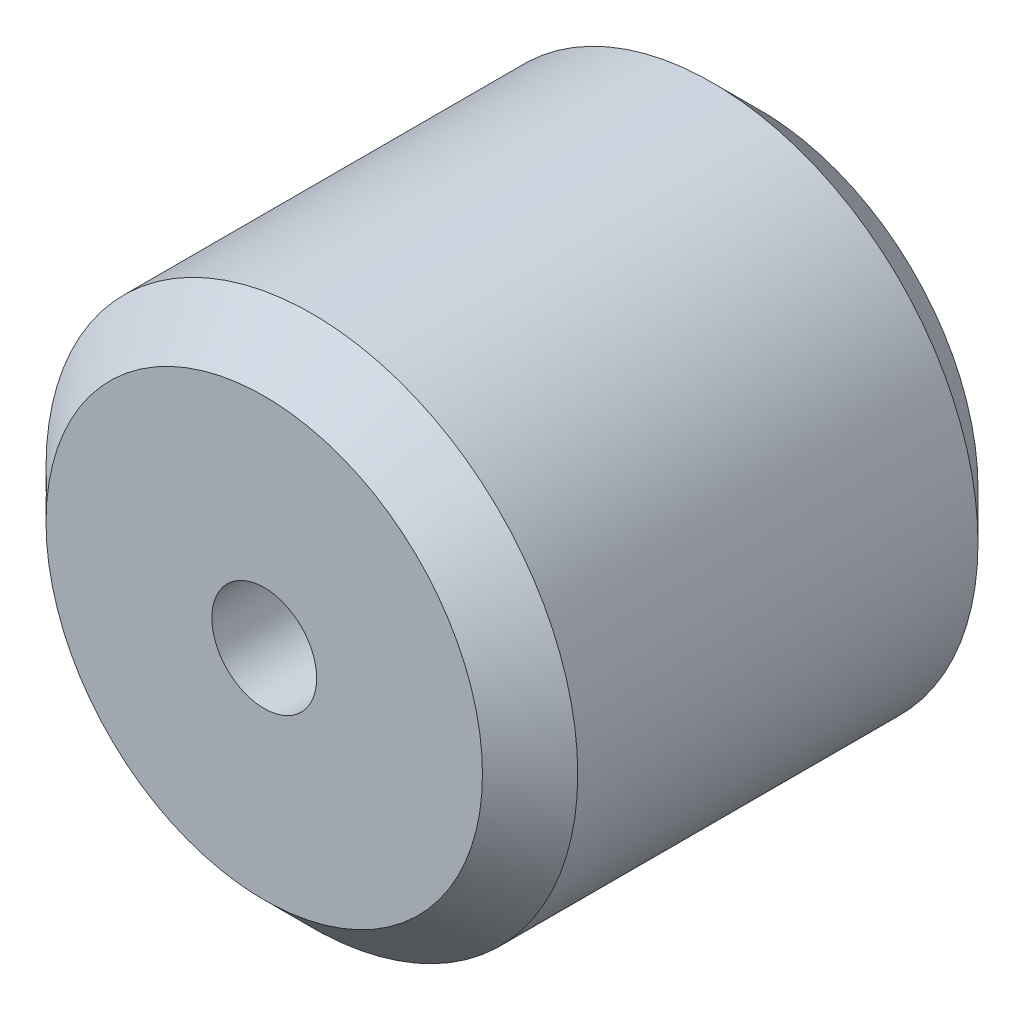
ISO-10303-21;
HEADER;
FILE_DESCRIPTION(('STEP AP214'),'2;1');
FILE_NAME('part.step','',(''),(''),'','','');
FILE_SCHEMA(('AUTOMOTIVE_DESIGN { 1 0 10303 214 1 1 1 1 }'));
ENDSEC;
DATA;
#1=APPLICATION_CONTEXT('core data for automotive mechanical design processes');
#2=APPLICATION_PROTOCOL_DEFINITION('international standard','automotive_design',2000,#1);
#3=PRODUCT_CONTEXT('',#1,'mechanical');
#4=PRODUCT('Part','Part','',(#3));
#5=PRODUCT_RELATED_PRODUCT_CATEGORY('part','',(#4));
#6=PRODUCT_DEFINITION_FORMATION('','',#4);
#7=PRODUCT_DEFINITION_CONTEXT('part definition',#1,'design');
#8=PRODUCT_DEFINITION('design','',#6,#7);
#9=PRODUCT_DEFINITION_SHAPE('','',#8);
#10=(LENGTH_UNIT() NAMED_UNIT(*) SI_UNIT(.MILLI.,.METRE.));
#11=(NAMED_UNIT(*) PLANE_ANGLE_UNIT() SI_UNIT($,.RADIAN.));
#12=(NAMED_UNIT(*) SI_UNIT($,.STERADIAN.) SOLID_ANGLE_UNIT());
#13=UNCERTAINTY_MEASURE_WITH_UNIT(LENGTH_MEASURE(1.E-05),#10,'distance_accuracy_value','');
#14=(GEOMETRIC_REPRESENTATION_CONTEXT(3) GLOBAL_UNCERTAINTY_ASSIGNED_CONTEXT((#13)) GLOBAL_UNIT_ASSIGNED_CONTEXT((#10,
#11,#12)) REPRESENTATION_CONTEXT('',''));
#15=CARTESIAN_POINT('',(0.,0.,0.));
#16=DIRECTION('',(0.,0.,1.));
#17=DIRECTION('',(1.,0.,0.));
#18=AXIS2_PLACEMENT_3D('',#15,#16,#17);
#19=CARTESIAN_POINT('',(0.,0.,0.));
#20=DIRECTION('',(0.,0.,1.));
#21=DIRECTION('',(-1.,0.,0.));
#22=AXIS2_PLACEMENT_3D('',#19,#20,#21);
#23=CYLINDRICAL_SURFACE('',#22,3.4925);
#24=CARTESIAN_POINT('',(0.,0.,33.02));
#25=DIRECTION('',(0.,0.,-1.));
#26=DIRECTION('',(-1.,0.,0.));
#27=AXIS2_PLACEMENT_3D('',#24,#25,#26);
#28=CIRCLE('',#27,3.4925);
#29=CARTESIAN_POINT('',(3.4925,0.,33.02));
#30=VERTEX_POINT('',#29);
#31=EDGE_CURVE('E21',#30,#30,#28,.T.);
#32=ORIENTED_EDGE('',*,*,#31,.F.);
#33=DIRECTION('',(0.,0.,-1.));
#34=VECTOR('',#33,1.);
#35=CARTESIAN_POINT('',(3.4925,0.,0.));
#36=LINE('',#35,#34);
#37=CARTESIAN_POINT('',(3.4925,0.,0.));
#38=VERTEX_POINT('',#37);
#39=EDGE_CURVE('E11',#30,#38,#36,.T.);
#40=ORIENTED_EDGE('',*,*,#39,.T.);
#41=CARTESIAN_POINT('',(0.,0.,0.));
#42=DIRECTION('',(0.,0.,-1.));
#43=DIRECTION('',(-1.,0.,0.));
#44=AXIS2_PLACEMENT_3D('',#41,#42,#43);
#45=CIRCLE('',#44,3.4925);
#46=EDGE_CURVE('E82',#38,#38,#45,.T.);
#47=ORIENTED_EDGE('',*,*,#46,.T.);
#48=ORIENTED_EDGE('',*,*,#39,.F.);
#49=EDGE_LOOP('',(#32,#40,#47,#48));
#50=FACE_BOUND('',#49,.T.);
#51=ADVANCED_FACE('F17',(#50),#23,.F.);
#52=CARTESIAN_POINT('',(0.,0.,33.02));
#53=DIRECTION('',(0.,0.,1.));
#54=DIRECTION('',(1.,0.,0.));
#55=AXIS2_PLACEMENT_3D('',#52,#53,#54);
#56=PLANE('',#55);
#57=ORIENTED_EDGE('',*,*,#31,.T.);
#58=EDGE_LOOP('',(#57));
#59=FACE_BOUND('',#58,.T.);
#60=CARTESIAN_POINT('',(0.,0.,33.02));
#61=DIRECTION('',(0.,0.,-1.));
#62=DIRECTION('',(-1.,0.,0.));
#63=AXIS2_PLACEMENT_3D('',#60,#61,#62);
#64=CIRCLE('',#63,14.5415);
#65=CARTESIAN_POINT('',(14.5415,0.,33.02));
#66=VERTEX_POINT('',#65);
#67=EDGE_CURVE('E98',#66,#66,#64,.T.);
#68=ORIENTED_EDGE('',*,*,#67,.F.);
#69=EDGE_LOOP('',(#68));
#70=FACE_BOUND('',#69,.T.);
#71=ADVANCED_FACE('F19',(#59,#70),#56,.T.);
#72=CARTESIAN_POINT('',(0.,0.,31.4325));
#73=DIRECTION('',(0.,0.,-1.));
#74=DIRECTION('',(-1.,0.,0.));
#75=AXIS2_PLACEMENT_3D('',#72,#73,#74);
#76=CONICAL_SURFACE('',#75,16.129,0.785398163397449);
#77=ORIENTED_EDGE('',*,*,#67,.T.);
#78=DIRECTION('',(0.707106781186548,0.,-0.707106781186547));
#79=VECTOR('',#78,1.);
#80=CARTESIAN_POINT('',(16.129,0.,31.4325));
#81=LINE('',#80,#79);
#82=CARTESIAN_POINT('',(17.7165,0.,29.845));
#83=VERTEX_POINT('',#82);
#84=EDGE_CURVE('E47',#66,#83,#81,.T.);
#85=ORIENTED_EDGE('',*,*,#84,.T.);
#86=CARTESIAN_POINT('',(0.,0.,29.845));
#87=DIRECTION('',(0.,0.,1.));
#88=DIRECTION('',(-1.,0.,0.));
#89=AXIS2_PLACEMENT_3D('',#86,#87,#88);
#90=CIRCLE('',#89,17.7165);
#91=CARTESIAN_POINT('',(-17.7165,0.,29.845));
#92=VERTEX_POINT('',#91);
#93=EDGE_CURVE('E104',#83,#92,#90,.T.);
#94=ORIENTED_EDGE('',*,*,#93,.T.);
#95=CARTESIAN_POINT('',(0.,0.,29.845));
#96=DIRECTION('',(0.,0.,1.));
#97=DIRECTION('',(-1.,0.,0.));
#98=AXIS2_PLACEMENT_3D('',#95,#96,#97);
#99=CIRCLE('',#98,17.7165);
#100=EDGE_CURVE('E79',#92,#83,#99,.T.);
#101=ORIENTED_EDGE('',*,*,#100,.T.);
#102=ORIENTED_EDGE('',*,*,#84,.F.);
#103=EDGE_LOOP('',(#77,#85,#94,#101,#102));
#104=FACE_BOUND('',#103,.T.);
#105=ADVANCED_FACE('F118',(#104),#76,.T.);
#106=CARTESIAN_POINT('',(0.,0.,0.));
#107=DIRECTION('',(0.,0.,1.));
#108=DIRECTION('',(1.,0.,0.));
#109=AXIS2_PLACEMENT_3D('',#106,#107,#108);
#110=PLANE('',#109);
#111=ORIENTED_EDGE('',*,*,#46,.F.);
#112=EDGE_LOOP('',(#111));
#113=FACE_BOUND('',#112,.T.);
#114=CARTESIAN_POINT('',(0.,0.,0.));
#115=DIRECTION('',(0.,0.,1.));
#116=DIRECTION('',(-1.,0.,0.));
#117=AXIS2_PLACEMENT_3D('',#114,#115,#116);
#118=CIRCLE('',#117,14.5415);
#119=CARTESIAN_POINT('',(14.5415,0.,0.));
#120=VERTEX_POINT('',#119);
#121=EDGE_CURVE('E101',#120,#120,#118,.T.);
#122=ORIENTED_EDGE('',*,*,#121,.F.);
#123=EDGE_LOOP('',(#122));
#124=FACE_BOUND('',#123,.T.);
#125=ADVANCED_FACE('F115',(#113,#124),#110,.F.);
#126=CARTESIAN_POINT('',(0.,0.,0.));
#127=DIRECTION('',(0.,0.,1.));
#128=DIRECTION('',(1.,0.,0.));
#129=AXIS2_PLACEMENT_3D('',#126,#127,#128);
#130=CYLINDRICAL_SURFACE('',#129,17.7165);
#131=ORIENTED_EDGE('',*,*,#93,.F.);
#132=ORIENTED_EDGE('',*,*,#100,.F.);
#133=DIRECTION('',(0.,0.,-1.));
#134=VECTOR('',#133,1.);
#135=CARTESIAN_POINT('',(-17.7165,0.,0.));
#136=LINE('',#135,#134);
#137=CARTESIAN_POINT('',(-17.7165,0.,3.175));
#138=VERTEX_POINT('',#137);
#139=EDGE_CURVE('E73',#92,#138,#136,.T.);
#140=ORIENTED_EDGE('',*,*,#139,.T.);
#141=CARTESIAN_POINT('',(0.,0.,3.175));
#142=DIRECTION('',(0.,0.,-1.));
#143=DIRECTION('',(-1.,0.,0.));
#144=AXIS2_PLACEMENT_3D('',#141,#142,#143);
#145=CIRCLE('',#144,17.7165);
#146=CARTESIAN_POINT('',(17.7165,0.,3.175));
#147=VERTEX_POINT('',#146);
#148=EDGE_CURVE('E78',#147,#138,#145,.T.);
#149=ORIENTED_EDGE('',*,*,#148,.F.);
#150=CARTESIAN_POINT('',(0.,0.,3.175));
#151=DIRECTION('',(0.,0.,-1.));
#152=DIRECTION('',(-1.,0.,0.));
#153=AXIS2_PLACEMENT_3D('',#150,#151,#152);
#154=CIRCLE('',#153,17.7165);
#155=EDGE_CURVE('E85',#138,#147,#154,.T.);
#156=ORIENTED_EDGE('',*,*,#155,.F.);
#157=ORIENTED_EDGE('',*,*,#139,.F.);
#158=EDGE_LOOP('',(#131,#132,#140,#149,#156,#157));
#159=FACE_BOUND('',#158,.T.);
#160=ADVANCED_FACE('F76',(#159),#130,.T.);
#161=CARTESIAN_POINT('',(0.,0.,1.5875));
#162=DIRECTION('',(0.,0.,1.));
#163=DIRECTION('',(-1.,0.,0.));
#164=AXIS2_PLACEMENT_3D('',#161,#162,#163);
#165=CONICAL_SURFACE('',#164,16.129,0.785398163397448);
#166=ORIENTED_EDGE('',*,*,#148,.T.);
#167=ORIENTED_EDGE('',*,*,#155,.T.);
#168=DIRECTION('',(-0.707106781186548,0.,-0.707106781186547));
#169=VECTOR('',#168,1.);
#170=CARTESIAN_POINT('',(16.129,0.,1.5875));
#171=LINE('',#170,#169);
#172=EDGE_CURVE('E89',#147,#120,#171,.T.);
#173=ORIENTED_EDGE('',*,*,#172,.T.);
#174=ORIENTED_EDGE('',*,*,#121,.T.);
#175=ORIENTED_EDGE('',*,*,#172,.F.);
#176=EDGE_LOOP('',(#166,#167,#173,#174,#175));
#177=FACE_BOUND('',#176,.T.);
#178=ADVANCED_FACE('F91',(#177),#165,.T.);
#179=CLOSED_SHELL('',(#51,#71,#105,#125,#160,#178));
#180=MANIFOLD_SOLID_BREP('B1',#179);
#181=ADVANCED_BREP_SHAPE_REPRESENTATION('',(#18,#180),#14);
#182=SHAPE_DEFINITION_REPRESENTATION(#9,#181);
ENDSEC;
END-ISO-10303-21;
